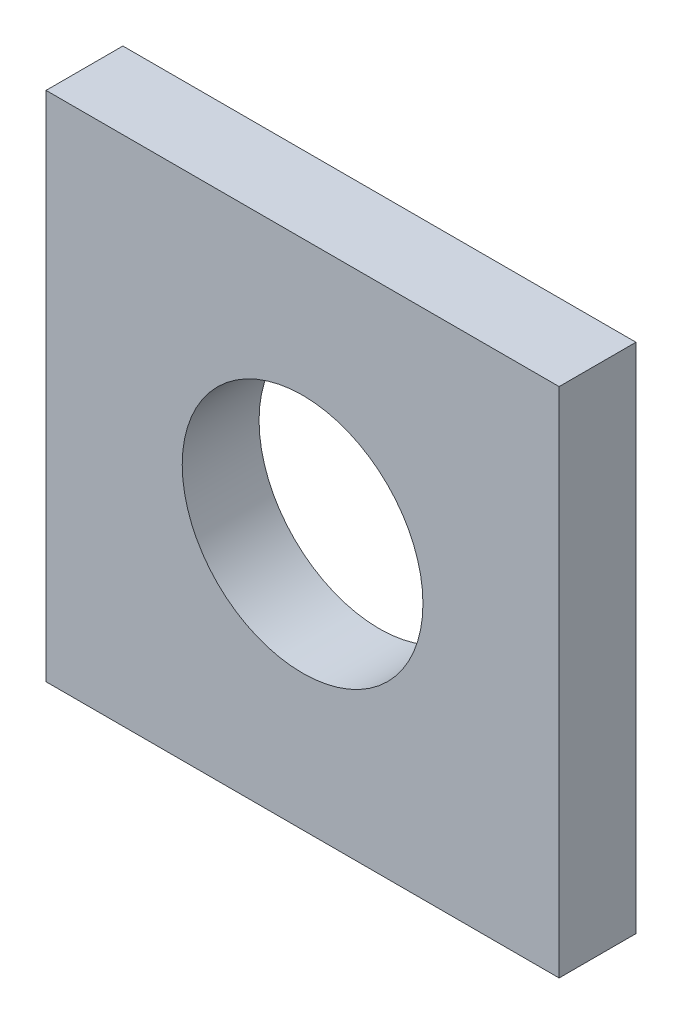
ISO-10303-21;
HEADER;
FILE_DESCRIPTION(('STEP AP214'),'2;1');
FILE_NAME('part.step','',(''),(''),'','','');
FILE_SCHEMA(('AUTOMOTIVE_DESIGN { 1 0 10303 214 1 1 1 1 }'));
ENDSEC;
DATA;
#1=APPLICATION_CONTEXT('core data for automotive mechanical design processes');
#2=APPLICATION_PROTOCOL_DEFINITION('international standard','automotive_design',2000,#1);
#3=PRODUCT_CONTEXT('',#1,'mechanical');
#4=PRODUCT('Part','Part','',(#3));
#5=PRODUCT_RELATED_PRODUCT_CATEGORY('part','',(#4));
#6=PRODUCT_DEFINITION_FORMATION('','',#4);
#7=PRODUCT_DEFINITION_CONTEXT('part definition',#1,'design');
#8=PRODUCT_DEFINITION('design','',#6,#7);
#9=PRODUCT_DEFINITION_SHAPE('','',#8);
#10=(LENGTH_UNIT() NAMED_UNIT(*) SI_UNIT(.MILLI.,.METRE.));
#11=(NAMED_UNIT(*) PLANE_ANGLE_UNIT() SI_UNIT($,.RADIAN.));
#12=(NAMED_UNIT(*) SI_UNIT($,.STERADIAN.) SOLID_ANGLE_UNIT());
#13=UNCERTAINTY_MEASURE_WITH_UNIT(LENGTH_MEASURE(1.E-05),#10,'distance_accuracy_value','');
#14=(GEOMETRIC_REPRESENTATION_CONTEXT(3) GLOBAL_UNCERTAINTY_ASSIGNED_CONTEXT((#13)) GLOBAL_UNIT_ASSIGNED_CONTEXT((#10,
#11,#12)) REPRESENTATION_CONTEXT('',''));
#15=CARTESIAN_POINT('',(0.,0.,0.));
#16=DIRECTION('',(0.,0.,1.));
#17=DIRECTION('',(1.,0.,0.));
#18=AXIS2_PLACEMENT_3D('',#15,#16,#17);
#19=CARTESIAN_POINT('',(0.,-66.1188296639629,15.));
#20=DIRECTION('',(0.,1.,0.));
#21=DIRECTION('',(-1.,0.,0.));
#22=AXIS2_PLACEMENT_3D('',#19,#20,#21);
#23=PLANE('',#22);
#24=DIRECTION('',(1.,0.,0.));
#25=VECTOR('',#24,1.);
#26=CARTESIAN_POINT('',(0.,-66.1188296639629,0.));
#27=LINE('',#26,#25);
#28=CARTESIAN_POINT('',(-76.3328361903973,-66.1188296639629,0.));
#29=VERTEX_POINT('',#28);
#30=CARTESIAN_POINT('',(23.8408340271825,-66.1188296639629,0.));
#31=VERTEX_POINT('',#30);
#32=EDGE_CURVE('E101',#29,#31,#27,.T.);
#33=ORIENTED_EDGE('',*,*,#32,.T.);
#34=DIRECTION('',(0.,0.,-1.));
#35=VECTOR('',#34,1.);
#36=CARTESIAN_POINT('',(23.8408340271825,-66.1188296639629,15.));
#37=LINE('',#36,#35);
#38=CARTESIAN_POINT('',(23.8408340271825,-66.1188296639629,15.));
#39=VERTEX_POINT('',#38);
#40=EDGE_CURVE('E11',#39,#31,#37,.T.);
#41=ORIENTED_EDGE('',*,*,#40,.F.);
#42=DIRECTION('',(1.,0.,0.));
#43=VECTOR('',#42,1.);
#44=CARTESIAN_POINT('',(0.,-66.1188296639629,15.));
#45=LINE('',#44,#43);
#46=CARTESIAN_POINT('',(-76.3328361903973,-66.1188296639629,15.));
#47=VERTEX_POINT('',#46);
#48=EDGE_CURVE('E74',#47,#39,#45,.T.);
#49=ORIENTED_EDGE('',*,*,#48,.F.);
#50=DIRECTION('',(0.,0.,-1.));
#51=VECTOR('',#50,1.);
#52=CARTESIAN_POINT('',(-76.3328361903973,-66.1188296639629,15.));
#53=LINE('',#52,#51);
#54=EDGE_CURVE('E100',#47,#29,#53,.T.);
#55=ORIENTED_EDGE('',*,*,#54,.T.);
#56=EDGE_LOOP('',(#33,#41,#49,#55));
#57=FACE_BOUND('',#56,.T.);
#58=ADVANCED_FACE('F35',(#57),#23,.F.);
#59=CARTESIAN_POINT('',(23.8408340271825,0.,15.));
#60=DIRECTION('',(1.,0.,0.));
#61=DIRECTION('',(0.,1.,0.));
#62=AXIS2_PLACEMENT_3D('',#59,#60,#61);
#63=PLANE('',#62);
#64=DIRECTION('',(0.,-1.,0.));
#65=VECTOR('',#64,1.);
#66=CARTESIAN_POINT('',(23.8408340271825,0.,0.));
#67=LINE('',#66,#65);
#68=CARTESIAN_POINT('',(23.8408340271825,33.8811703360371,0.));
#69=VERTEX_POINT('',#68);
#70=EDGE_CURVE('E83',#69,#31,#67,.T.);
#71=ORIENTED_EDGE('',*,*,#70,.F.);
#72=DIRECTION('',(0.,0.,-1.));
#73=VECTOR('',#72,1.);
#74=CARTESIAN_POINT('',(23.8408340271825,33.8811703360371,15.));
#75=LINE('',#74,#73);
#76=CARTESIAN_POINT('',(23.8408340271825,33.8811703360371,15.));
#77=VERTEX_POINT('',#76);
#78=EDGE_CURVE('E43',#77,#69,#75,.T.);
#79=ORIENTED_EDGE('',*,*,#78,.F.);
#80=DIRECTION('',(0.,-1.,0.));
#81=VECTOR('',#80,1.);
#82=CARTESIAN_POINT('',(23.8408340271825,0.,15.));
#83=LINE('',#82,#81);
#84=EDGE_CURVE('E81',#77,#39,#83,.T.);
#85=ORIENTED_EDGE('',*,*,#84,.T.);
#86=ORIENTED_EDGE('',*,*,#40,.T.);
#87=EDGE_LOOP('',(#71,#79,#85,#86));
#88=FACE_BOUND('',#87,.T.);
#89=ADVANCED_FACE('F80',(#88),#63,.T.);
#90=CARTESIAN_POINT('',(0.,33.8811703360371,15.));
#91=DIRECTION('',(0.,1.,0.));
#92=DIRECTION('',(0.,0.,1.));
#93=AXIS2_PLACEMENT_3D('',#90,#91,#92);
#94=PLANE('',#93);
#95=DIRECTION('',(1.,0.,0.));
#96=VECTOR('',#95,1.);
#97=CARTESIAN_POINT('',(0.,33.8811703360371,0.));
#98=LINE('',#97,#96);
#99=CARTESIAN_POINT('',(-76.3328361903973,33.8811703360371,0.));
#100=VERTEX_POINT('',#99);
#101=EDGE_CURVE('E105',#100,#69,#98,.T.);
#102=ORIENTED_EDGE('',*,*,#101,.F.);
#103=DIRECTION('',(0.,0.,-1.));
#104=VECTOR('',#103,1.);
#105=CARTESIAN_POINT('',(-76.3328361903973,33.8811703360371,15.));
#106=LINE('',#105,#104);
#107=CARTESIAN_POINT('',(-76.3328361903973,33.8811703360371,15.));
#108=VERTEX_POINT('',#107);
#109=EDGE_CURVE('E66',#108,#100,#106,.T.);
#110=ORIENTED_EDGE('',*,*,#109,.F.);
#111=DIRECTION('',(1.,0.,0.));
#112=VECTOR('',#111,1.);
#113=CARTESIAN_POINT('',(0.,33.8811703360371,15.));
#114=LINE('',#113,#112);
#115=EDGE_CURVE('E90',#108,#77,#114,.T.);
#116=ORIENTED_EDGE('',*,*,#115,.T.);
#117=ORIENTED_EDGE('',*,*,#78,.T.);
#118=EDGE_LOOP('',(#102,#110,#116,#117));
#119=FACE_BOUND('',#118,.T.);
#120=ADVANCED_FACE('F92',(#119),#94,.T.);
#121=CARTESIAN_POINT('',(-76.3328361903973,0.,15.));
#122=DIRECTION('',(1.,0.,0.));
#123=DIRECTION('',(0.,0.,-1.));
#124=AXIS2_PLACEMENT_3D('',#121,#122,#123);
#125=PLANE('',#124);
#126=DIRECTION('',(0.,-1.,0.));
#127=VECTOR('',#126,1.);
#128=CARTESIAN_POINT('',(-76.3328361903973,0.,0.));
#129=LINE('',#128,#127);
#130=EDGE_CURVE('E69',#100,#29,#129,.T.);
#131=ORIENTED_EDGE('',*,*,#130,.T.);
#132=ORIENTED_EDGE('',*,*,#54,.F.);
#133=DIRECTION('',(0.,-1.,0.));
#134=VECTOR('',#133,1.);
#135=CARTESIAN_POINT('',(-76.3328361903973,0.,15.));
#136=LINE('',#135,#134);
#137=EDGE_CURVE('E51',#108,#47,#136,.T.);
#138=ORIENTED_EDGE('',*,*,#137,.F.);
#139=ORIENTED_EDGE('',*,*,#109,.T.);
#140=EDGE_LOOP('',(#131,#132,#138,#139));
#141=FACE_BOUND('',#140,.T.);
#142=ADVANCED_FACE('F123',(#141),#125,.F.);
#143=CARTESIAN_POINT('',(-26.2460010816074,-16.1188296639629,15.));
#144=DIRECTION('',(0.,0.,-1.));
#145=DIRECTION('',(-1.,0.,0.));
#146=AXIS2_PLACEMENT_3D('',#143,#144,#145);
#147=CYLINDRICAL_SURFACE('',#146,23.5);
#148=CARTESIAN_POINT('',(-26.2460010816074,-16.1188296639629,15.));
#149=DIRECTION('',(0.,0.,1.));
#150=DIRECTION('',(1.,0.,0.));
#151=AXIS2_PLACEMENT_3D('',#148,#149,#150);
#152=CIRCLE('',#151,23.5);
#153=CARTESIAN_POINT('',(-2.74600108160739,-16.1188296639629,15.));
#154=VERTEX_POINT('',#153);
#155=EDGE_CURVE('E94',#154,#154,#152,.T.);
#156=ORIENTED_EDGE('',*,*,#155,.T.);
#157=EDGE_LOOP('',(#156));
#158=FACE_BOUND('',#157,.T.);
#159=CARTESIAN_POINT('',(-26.2460010816074,-16.1188296639629,0.));
#160=DIRECTION('',(0.,0.,1.));
#161=DIRECTION('',(1.,0.,0.));
#162=AXIS2_PLACEMENT_3D('',#159,#160,#161);
#163=CIRCLE('',#162,23.5);
#164=CARTESIAN_POINT('',(-2.74600108160739,-16.1188296639629,0.));
#165=VERTEX_POINT('',#164);
#166=EDGE_CURVE('E108',#165,#165,#163,.T.);
#167=ORIENTED_EDGE('',*,*,#166,.F.);
#168=EDGE_LOOP('',(#167));
#169=FACE_BOUND('',#168,.T.);
#170=ADVANCED_FACE('F121',(#158,#169),#147,.F.);
#171=CARTESIAN_POINT('',(0.,0.,15.));
#172=DIRECTION('',(0.,0.,1.));
#173=DIRECTION('',(1.,0.,0.));
#174=AXIS2_PLACEMENT_3D('',#171,#172,#173);
#175=PLANE('',#174);
#176=ORIENTED_EDGE('',*,*,#48,.T.);
#177=ORIENTED_EDGE('',*,*,#84,.F.);
#178=ORIENTED_EDGE('',*,*,#115,.F.);
#179=ORIENTED_EDGE('',*,*,#137,.T.);
#180=EDGE_LOOP('',(#176,#177,#178,#179));
#181=FACE_BOUND('',#180,.T.);
#182=ORIENTED_EDGE('',*,*,#155,.F.);
#183=EDGE_LOOP('',(#182));
#184=FACE_BOUND('',#183,.T.);
#185=ADVANCED_FACE('F88',(#181,#184),#175,.T.);
#186=CARTESIAN_POINT('',(0.,0.,0.));
#187=DIRECTION('',(0.,0.,1.));
#188=DIRECTION('',(1.,0.,0.));
#189=AXIS2_PLACEMENT_3D('',#186,#187,#188);
#190=PLANE('',#189);
#191=ORIENTED_EDGE('',*,*,#32,.F.);
#192=ORIENTED_EDGE('',*,*,#130,.F.);
#193=ORIENTED_EDGE('',*,*,#101,.T.);
#194=ORIENTED_EDGE('',*,*,#70,.T.);
#195=EDGE_LOOP('',(#191,#192,#193,#194));
#196=FACE_BOUND('',#195,.T.);
#197=ORIENTED_EDGE('',*,*,#166,.T.);
#198=EDGE_LOOP('',(#197));
#199=FACE_BOUND('',#198,.T.);
#200=ADVANCED_FACE('F115',(#196,#199),#190,.F.);
#201=CLOSED_SHELL('',(#58,#89,#120,#142,#170,#185,#200));
#202=MANIFOLD_SOLID_BREP('B2',#201);
#203=ADVANCED_BREP_SHAPE_REPRESENTATION('',(#18,#202),#14);
#204=SHAPE_DEFINITION_REPRESENTATION(#9,#203);
ENDSEC;
END-ISO-10303-21;
